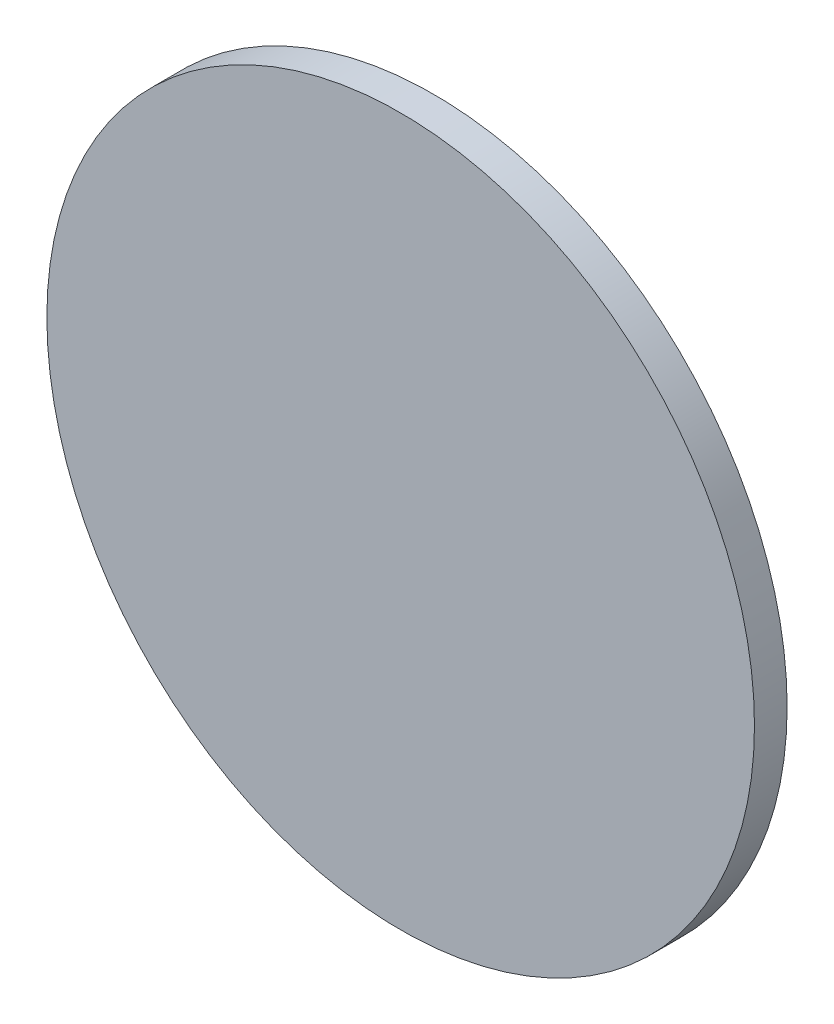
ISO-10303-21;
HEADER;
FILE_DESCRIPTION(('STEP AP214'),'2;1');
FILE_NAME('part.step','',(''),(''),'','','');
FILE_SCHEMA(('AUTOMOTIVE_DESIGN { 1 0 10303 214 1 1 1 1 }'));
ENDSEC;
DATA;
#1=APPLICATION_CONTEXT('core data for automotive mechanical design processes');
#2=APPLICATION_PROTOCOL_DEFINITION('international standard','automotive_design',2000,#1);
#3=PRODUCT_CONTEXT('',#1,'mechanical');
#4=PRODUCT('Part','Part','',(#3));
#5=PRODUCT_RELATED_PRODUCT_CATEGORY('part','',(#4));
#6=PRODUCT_DEFINITION_FORMATION('','',#4);
#7=PRODUCT_DEFINITION_CONTEXT('part definition',#1,'design');
#8=PRODUCT_DEFINITION('design','',#6,#7);
#9=PRODUCT_DEFINITION_SHAPE('','',#8);
#10=(LENGTH_UNIT() NAMED_UNIT(*) SI_UNIT(.MILLI.,.METRE.));
#11=(NAMED_UNIT(*) PLANE_ANGLE_UNIT() SI_UNIT($,.RADIAN.));
#12=(NAMED_UNIT(*) SI_UNIT($,.STERADIAN.) SOLID_ANGLE_UNIT());
#13=UNCERTAINTY_MEASURE_WITH_UNIT(LENGTH_MEASURE(1.E-05),#10,'distance_accuracy_value','');
#14=(GEOMETRIC_REPRESENTATION_CONTEXT(3) GLOBAL_UNCERTAINTY_ASSIGNED_CONTEXT((#13)) GLOBAL_UNIT_ASSIGNED_CONTEXT((#10,
#11,#12)) REPRESENTATION_CONTEXT('',''));
#15=CARTESIAN_POINT('',(0.,0.,0.));
#16=DIRECTION('',(0.,0.,1.));
#17=DIRECTION('',(1.,0.,0.));
#18=AXIS2_PLACEMENT_3D('',#15,#16,#17);
#19=CARTESIAN_POINT('',(0.,0.,6.));
#20=DIRECTION('',(0.,0.,-1.));
#21=DIRECTION('',(-1.,0.,0.));
#22=AXIS2_PLACEMENT_3D('',#19,#20,#21);
#23=CYLINDRICAL_SURFACE('',#22,65.);
#24=CARTESIAN_POINT('',(0.,0.,6.));
#25=DIRECTION('',(0.,0.,1.));
#26=DIRECTION('',(1.,0.,0.));
#27=AXIS2_PLACEMENT_3D('',#24,#25,#26);
#28=CIRCLE('',#27,65.);
#29=CARTESIAN_POINT('',(65.,0.,6.));
#30=VERTEX_POINT('',#29);
#31=EDGE_CURVE('E10',#30,#30,#28,.T.);
#32=ORIENTED_EDGE('',*,*,#31,.F.);
#33=EDGE_LOOP('',(#32));
#34=FACE_BOUND('',#33,.T.);
#35=CARTESIAN_POINT('',(0.,0.,0.));
#36=DIRECTION('',(0.,0.,1.));
#37=DIRECTION('',(1.,0.,0.));
#38=AXIS2_PLACEMENT_3D('',#35,#36,#37);
#39=CIRCLE('',#38,65.);
#40=CARTESIAN_POINT('',(65.,0.,0.));
#41=VERTEX_POINT('',#40);
#42=EDGE_CURVE('E34',#41,#41,#39,.T.);
#43=ORIENTED_EDGE('',*,*,#42,.T.);
#44=EDGE_LOOP('',(#43));
#45=FACE_BOUND('',#44,.T.);
#46=ADVANCED_FACE('F31',(#34,#45),#23,.T.);
#47=CARTESIAN_POINT('',(0.,0.,6.));
#48=DIRECTION('',(0.,0.,1.));
#49=DIRECTION('',(1.,0.,0.));
#50=AXIS2_PLACEMENT_3D('',#47,#48,#49);
#51=PLANE('',#50);
#52=ORIENTED_EDGE('',*,*,#31,.T.);
#53=EDGE_LOOP('',(#52));
#54=FACE_BOUND('',#53,.T.);
#55=ADVANCED_FACE('F46',(#54),#51,.T.);
#56=CARTESIAN_POINT('',(0.,0.,0.));
#57=DIRECTION('',(0.,0.,1.));
#58=DIRECTION('',(1.,0.,0.));
#59=AXIS2_PLACEMENT_3D('',#56,#57,#58);
#60=PLANE('',#59);
#61=ORIENTED_EDGE('',*,*,#42,.F.);
#62=EDGE_LOOP('',(#61));
#63=FACE_BOUND('',#62,.T.);
#64=ADVANCED_FACE('F44',(#63),#60,.F.);
#65=CLOSED_SHELL('',(#46,#55,#64));
#66=MANIFOLD_SOLID_BREP('B2',#65);
#67=ADVANCED_BREP_SHAPE_REPRESENTATION('',(#18,#66),#14);
#68=SHAPE_DEFINITION_REPRESENTATION(#9,#67);
ENDSEC;
END-ISO-10303-21;
